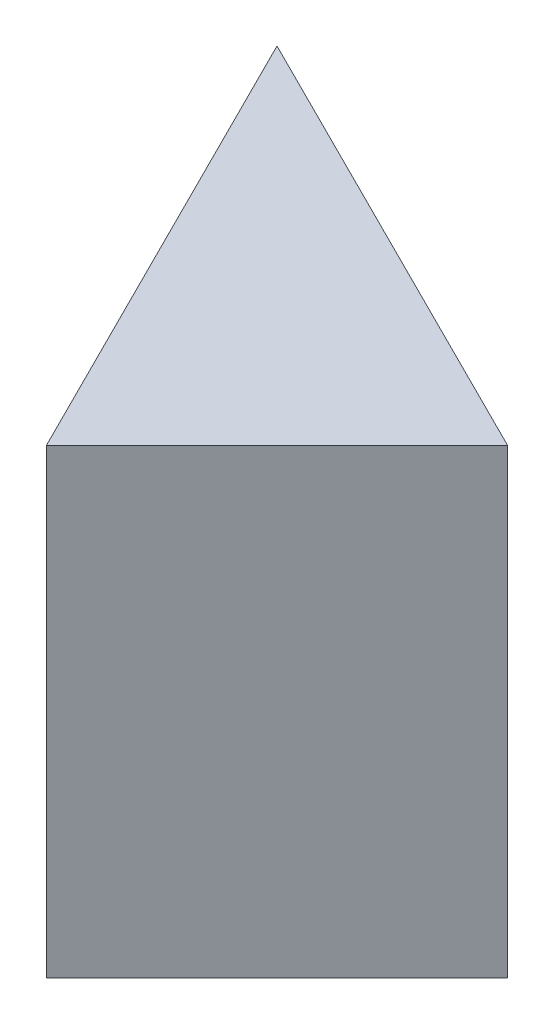
ISO-10303-21;
HEADER;
FILE_DESCRIPTION(('STEP AP214'),'2;1');
FILE_NAME('part.step','',(''),(''),'','','');
FILE_SCHEMA(('AUTOMOTIVE_DESIGN { 1 0 10303 214 1 1 1 1 }'));
ENDSEC;
DATA;
#1=APPLICATION_CONTEXT('core data for automotive mechanical design processes');
#2=APPLICATION_PROTOCOL_DEFINITION('international standard','automotive_design',2000,#1);
#3=PRODUCT_CONTEXT('',#1,'mechanical');
#4=PRODUCT('Part','Part','',(#3));
#5=PRODUCT_RELATED_PRODUCT_CATEGORY('part','',(#4));
#6=PRODUCT_DEFINITION_FORMATION('','',#4);
#7=PRODUCT_DEFINITION_CONTEXT('part definition',#1,'design');
#8=PRODUCT_DEFINITION('design','',#6,#7);
#9=PRODUCT_DEFINITION_SHAPE('','',#8);
#10=(LENGTH_UNIT() NAMED_UNIT(*) SI_UNIT(.MILLI.,.METRE.));
#11=(NAMED_UNIT(*) PLANE_ANGLE_UNIT() SI_UNIT($,.RADIAN.));
#12=(NAMED_UNIT(*) SI_UNIT($,.STERADIAN.) SOLID_ANGLE_UNIT());
#13=UNCERTAINTY_MEASURE_WITH_UNIT(LENGTH_MEASURE(1.E-05),#10,'distance_accuracy_value','');
#14=(GEOMETRIC_REPRESENTATION_CONTEXT(3) GLOBAL_UNCERTAINTY_ASSIGNED_CONTEXT((#13)) GLOBAL_UNIT_ASSIGNED_CONTEXT((#10,
#11,#12)) REPRESENTATION_CONTEXT('',''));
#15=CARTESIAN_POINT('',(0.,0.,0.));
#16=DIRECTION('',(0.,0.,1.));
#17=DIRECTION('',(1.,0.,0.));
#18=AXIS2_PLACEMENT_3D('',#15,#16,#17);
#19=CARTESIAN_POINT('',(0.,0.,20.));
#20=DIRECTION('',(0.,1.,0.));
#21=DIRECTION('',(0.,0.,1.));
#22=AXIS2_PLACEMENT_3D('',#19,#20,#21);
#23=PLANE('',#22);
#24=DIRECTION('',(0.894427190999916,0.,0.447213595499958));
#25=VECTOR('',#24,1.);
#26=CARTESIAN_POINT('',(20.,0.,10.));
#27=LINE('',#26,#25);
#28=CARTESIAN_POINT('',(0.,0.,0.));
#29=VERTEX_POINT('',#28);
#30=CARTESIAN_POINT('',(20.,0.,10.));
#31=VERTEX_POINT('',#30);
#32=EDGE_CURVE('E77',#29,#31,#27,.T.);
#33=ORIENTED_EDGE('',*,*,#32,.T.);
#34=DIRECTION('',(-0.707106781186548,0.,0.707106781186548));
#35=VECTOR('',#34,1.);
#36=CARTESIAN_POINT('',(20.,0.,10.));
#37=LINE('',#36,#35);
#38=CARTESIAN_POINT('',(10.,0.,20.));
#39=VERTEX_POINT('',#38);
#40=EDGE_CURVE('E64',#31,#39,#37,.T.);
#41=ORIENTED_EDGE('',*,*,#40,.T.);
#42=DIRECTION('',(-0.447213595499958,0.,-0.894427190999916));
#43=VECTOR('',#42,1.);
#44=CARTESIAN_POINT('',(10.,0.,20.));
#45=LINE('',#44,#43);
#46=EDGE_CURVE('E80',#39,#29,#45,.T.);
#47=ORIENTED_EDGE('',*,*,#46,.T.);
#48=EDGE_LOOP('',(#33,#41,#47));
#49=FACE_BOUND('',#48,.T.);
#50=ADVANCED_FACE('F33',(#49),#23,.F.);
#51=CARTESIAN_POINT('',(0.,20.,20.));
#52=DIRECTION('',(0.,-1.,0.));
#53=DIRECTION('',(0.,0.,-1.));
#54=AXIS2_PLACEMENT_3D('',#51,#52,#53);
#55=PLANE('',#54);
#56=DIRECTION('',(-0.447213595499958,0.,-0.894427190999916));
#57=VECTOR('',#56,1.);
#58=CARTESIAN_POINT('',(10.,20.,20.));
#59=LINE('',#58,#57);
#60=CARTESIAN_POINT('',(10.,20.,20.));
#61=VERTEX_POINT('',#60);
#62=CARTESIAN_POINT('',(0.,20.,0.));
#63=VERTEX_POINT('',#62);
#64=EDGE_CURVE('E46',#61,#63,#59,.T.);
#65=ORIENTED_EDGE('',*,*,#64,.F.);
#66=DIRECTION('',(-0.707106781186548,0.,0.707106781186548));
#67=VECTOR('',#66,1.);
#68=CARTESIAN_POINT('',(20.,20.,10.));
#69=LINE('',#68,#67);
#70=CARTESIAN_POINT('',(20.,20.,10.));
#71=VERTEX_POINT('',#70);
#72=EDGE_CURVE('E71',#71,#61,#69,.T.);
#73=ORIENTED_EDGE('',*,*,#72,.F.);
#74=DIRECTION('',(0.894427190999916,0.,0.447213595499958));
#75=VECTOR('',#74,1.);
#76=CARTESIAN_POINT('',(20.,20.,10.));
#77=LINE('',#76,#75);
#78=EDGE_CURVE('E79',#63,#71,#77,.T.);
#79=ORIENTED_EDGE('',*,*,#78,.F.);
#80=EDGE_LOOP('',(#65,#73,#79));
#81=FACE_BOUND('',#80,.T.);
#82=ADVANCED_FACE('F89',(#81),#55,.F.);
#83=CARTESIAN_POINT('',(20.,0.,10.));
#84=DIRECTION('',(-0.447213595499958,0.,0.894427190999916));
#85=DIRECTION('',(0.894427190999916,0.,0.447213595499958));
#86=AXIS2_PLACEMENT_3D('',#83,#84,#85);
#87=PLANE('',#86);
#88=ORIENTED_EDGE('',*,*,#78,.T.);
#89=DIRECTION('',(0.,1.,0.));
#90=VECTOR('',#89,1.);
#91=CARTESIAN_POINT('',(20.,0.,10.));
#92=LINE('',#91,#90);
#93=EDGE_CURVE('E40',#31,#71,#92,.T.);
#94=ORIENTED_EDGE('',*,*,#93,.F.);
#95=ORIENTED_EDGE('',*,*,#32,.F.);
#96=DIRECTION('',(0.,-1.,0.));
#97=VECTOR('',#96,1.);
#98=CARTESIAN_POINT('',(0.,0.,0.));
#99=LINE('',#98,#97);
#100=EDGE_CURVE('E11',#63,#29,#99,.T.);
#101=ORIENTED_EDGE('',*,*,#100,.F.);
#102=EDGE_LOOP('',(#88,#94,#95,#101));
#103=FACE_BOUND('',#102,.T.);
#104=ADVANCED_FACE('F76',(#103),#87,.F.);
#105=CARTESIAN_POINT('',(10.,0.,20.));
#106=DIRECTION('',(0.894427190999916,0.,-0.447213595499958));
#107=DIRECTION('',(-0.447213595499958,0.,-0.894427190999916));
#108=AXIS2_PLACEMENT_3D('',#105,#106,#107);
#109=PLANE('',#108);
#110=ORIENTED_EDGE('',*,*,#64,.T.);
#111=ORIENTED_EDGE('',*,*,#100,.T.);
#112=ORIENTED_EDGE('',*,*,#46,.F.);
#113=DIRECTION('',(0.,1.,0.));
#114=VECTOR('',#113,1.);
#115=CARTESIAN_POINT('',(10.,0.,20.));
#116=LINE('',#115,#114);
#117=EDGE_CURVE('E68',#39,#61,#116,.T.);
#118=ORIENTED_EDGE('',*,*,#117,.T.);
#119=EDGE_LOOP('',(#110,#111,#112,#118));
#120=FACE_BOUND('',#119,.T.);
#121=ADVANCED_FACE('F88',(#120),#109,.F.);
#122=CARTESIAN_POINT('',(20.,0.,10.));
#123=DIRECTION('',(-0.707106781186548,0.,-0.707106781186548));
#124=DIRECTION('',(-0.707106781186548,0.,0.707106781186548));
#125=AXIS2_PLACEMENT_3D('',#122,#123,#124);
#126=PLANE('',#125);
#127=ORIENTED_EDGE('',*,*,#72,.T.);
#128=ORIENTED_EDGE('',*,*,#117,.F.);
#129=ORIENTED_EDGE('',*,*,#40,.F.);
#130=ORIENTED_EDGE('',*,*,#93,.T.);
#131=EDGE_LOOP('',(#127,#128,#129,#130));
#132=FACE_BOUND('',#131,.T.);
#133=ADVANCED_FACE('F66',(#132),#126,.F.);
#134=CLOSED_SHELL('',(#50,#82,#104,#121,#133));
#135=MANIFOLD_SOLID_BREP('B2',#134);
#136=ADVANCED_BREP_SHAPE_REPRESENTATION('',(#18,#135),#14);
#137=SHAPE_DEFINITION_REPRESENTATION(#9,#136);
ENDSEC;
END-ISO-10303-21;
